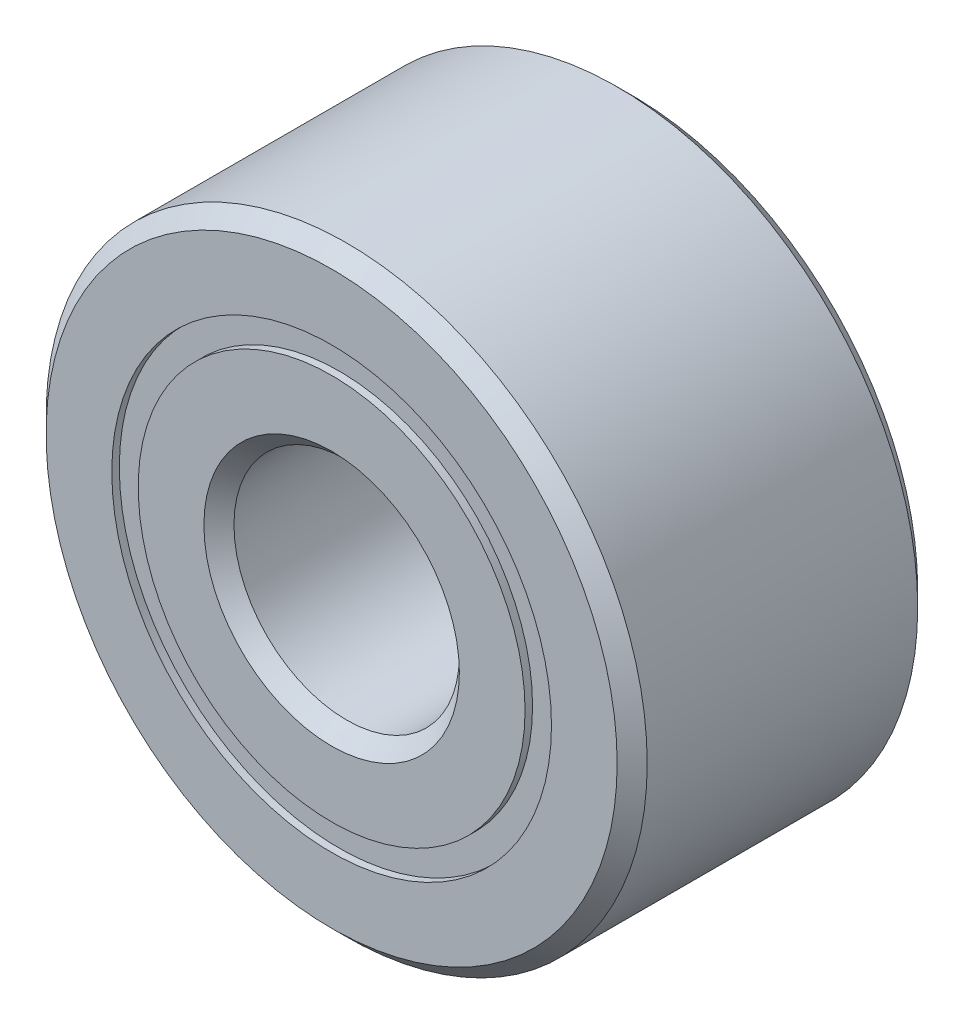
ISO-10303-21;
HEADER;
FILE_DESCRIPTION(('STEP AP214'),'2;1');
FILE_NAME('part.step','',(''),(''),'','','');
FILE_SCHEMA(('AUTOMOTIVE_DESIGN { 1 0 10303 214 1 1 1 1 }'));
ENDSEC;
DATA;
#1=APPLICATION_CONTEXT('core data for automotive mechanical design processes');
#2=APPLICATION_PROTOCOL_DEFINITION('international standard','automotive_design',2000,#1);
#3=PRODUCT_CONTEXT('',#1,'mechanical');
#4=PRODUCT('Part','Part','',(#3));
#5=PRODUCT_RELATED_PRODUCT_CATEGORY('part','',(#4));
#6=PRODUCT_DEFINITION_FORMATION('','',#4);
#7=PRODUCT_DEFINITION_CONTEXT('part definition',#1,'design');
#8=PRODUCT_DEFINITION('design','',#6,#7);
#9=PRODUCT_DEFINITION_SHAPE('','',#8);
#10=(LENGTH_UNIT() NAMED_UNIT(*) SI_UNIT(.MILLI.,.METRE.));
#11=(NAMED_UNIT(*) PLANE_ANGLE_UNIT() SI_UNIT($,.RADIAN.));
#12=(NAMED_UNIT(*) SI_UNIT($,.STERADIAN.) SOLID_ANGLE_UNIT());
#13=UNCERTAINTY_MEASURE_WITH_UNIT(LENGTH_MEASURE(1.E-05),#10,'distance_accuracy_value','');
#14=(GEOMETRIC_REPRESENTATION_CONTEXT(3) GLOBAL_UNCERTAINTY_ASSIGNED_CONTEXT((#13)) GLOBAL_UNIT_ASSIGNED_CONTEXT((#10,
#11,#12)) REPRESENTATION_CONTEXT('',''));
#15=CARTESIAN_POINT('',(0.,0.,0.));
#16=DIRECTION('',(0.,0.,1.));
#17=DIRECTION('',(1.,0.,0.));
#18=AXIS2_PLACEMENT_3D('',#15,#16,#17);
#19=CARTESIAN_POINT('',(0.,2.92582417582418,-1.9));
#20=DIRECTION('',(0.,0.,1.));
#21=DIRECTION('',(1.,0.,0.));
#22=AXIS2_PLACEMENT_3D('',#19,#20,#21);
#23=PLANE('',#22);
#24=CARTESIAN_POINT('',(0.,0.,-1.9));
#25=DIRECTION('',(0.,0.,1.));
#26=DIRECTION('',(1.,0.,0.));
#27=AXIS2_PLACEMENT_3D('',#24,#25,#26);
#28=CIRCLE('',#27,2.92582417582418);
#29=CARTESIAN_POINT('',(2.92582417582418,0.,-1.9));
#30=VERTEX_POINT('',#29);
#31=EDGE_CURVE('E57',#30,#30,#28,.T.);
#32=ORIENTED_EDGE('',*,*,#31,.F.);
#33=EDGE_LOOP('',(#32));
#34=FACE_BOUND('',#33,.T.);
#35=CARTESIAN_POINT('',(0.,0.,-1.9));
#36=DIRECTION('',(0.,0.,1.));
#37=DIRECTION('',(1.,0.,0.));
#38=AXIS2_PLACEMENT_3D('',#35,#36,#37);
#39=CIRCLE('',#38,2.57417582417583);
#40=CARTESIAN_POINT('',(2.57417582417583,0.,-1.9));
#41=VERTEX_POINT('',#40);
#42=EDGE_CURVE('E11',#41,#41,#39,.T.);
#43=ORIENTED_EDGE('',*,*,#42,.T.);
#44=EDGE_LOOP('',(#43));
#45=FACE_BOUND('',#44,.T.);
#46=ADVANCED_FACE('F43',(#34,#45),#23,.F.);
#47=CARTESIAN_POINT('',(0.,0.,2.));
#48=DIRECTION('',(0.,0.,1.));
#49=DIRECTION('',(1.,0.,0.));
#50=AXIS2_PLACEMENT_3D('',#47,#48,#49);
#51=CYLINDRICAL_SURFACE('',#50,2.57417582417583);
#52=ORIENTED_EDGE('',*,*,#42,.F.);
#53=EDGE_LOOP('',(#52));
#54=FACE_BOUND('',#53,.T.);
#55=CARTESIAN_POINT('',(0.,0.,-0.90611125012019));
#56=DIRECTION('',(0.,0.,1.));
#57=DIRECTION('',(1.,0.,0.));
#58=AXIS2_PLACEMENT_3D('',#55,#56,#57);
#59=CIRCLE('',#58,2.57417582417583);
#60=CARTESIAN_POINT('',(2.57417582417583,0.,-0.90611125012019));
#61=VERTEX_POINT('',#60);
#62=EDGE_CURVE('E49',#61,#61,#59,.T.);
#63=ORIENTED_EDGE('',*,*,#62,.T.);
#64=EDGE_LOOP('',(#63));
#65=FACE_BOUND('',#64,.T.);
#66=ADVANCED_FACE('F66',(#54,#65),#51,.F.);
#67=CARTESIAN_POINT('',(0.,2.92582417582418,-0.90611125012019));
#68=DIRECTION('',(0.,0.,-1.));
#69=DIRECTION('',(-1.,0.,0.));
#70=AXIS2_PLACEMENT_3D('',#67,#68,#69);
#71=PLANE('',#70);
#72=ORIENTED_EDGE('',*,*,#62,.F.);
#73=EDGE_LOOP('',(#72));
#74=FACE_BOUND('',#73,.T.);
#75=CARTESIAN_POINT('',(0.,0.,-0.90611125012019));
#76=DIRECTION('',(0.,0.,1.));
#77=DIRECTION('',(1.,0.,0.));
#78=AXIS2_PLACEMENT_3D('',#75,#76,#77);
#79=CIRCLE('',#78,2.92582417582418);
#80=CARTESIAN_POINT('',(2.92582417582418,0.,-0.90611125012019));
#81=VERTEX_POINT('',#80);
#82=EDGE_CURVE('E53',#81,#81,#79,.T.);
#83=ORIENTED_EDGE('',*,*,#82,.T.);
#84=EDGE_LOOP('',(#83));
#85=FACE_BOUND('',#84,.T.);
#86=ADVANCED_FACE('F70',(#74,#85),#71,.F.);
#87=CARTESIAN_POINT('',(0.,0.,2.));
#88=DIRECTION('',(0.,0.,1.));
#89=DIRECTION('',(1.,0.,0.));
#90=AXIS2_PLACEMENT_3D('',#87,#88,#89);
#91=CYLINDRICAL_SURFACE('',#90,2.92582417582418);
#92=ORIENTED_EDGE('',*,*,#82,.F.);
#93=EDGE_LOOP('',(#92));
#94=FACE_BOUND('',#93,.T.);
#95=ORIENTED_EDGE('',*,*,#31,.T.);
#96=EDGE_LOOP('',(#95));
#97=FACE_BOUND('',#96,.T.);
#98=ADVANCED_FACE('F63',(#94,#97),#91,.T.);
#99=CLOSED_SHELL('',(#46,#66,#86,#98));
#100=MANIFOLD_SOLID_BREP('B2',#99);
#101=CARTESIAN_POINT('',(0.,2.92582417582418,1.9));
#102=DIRECTION('',(0.,0.,-1.));
#103=DIRECTION('',(-1.,0.,0.));
#104=AXIS2_PLACEMENT_3D('',#101,#102,#103);
#105=PLANE('',#104);
#106=CARTESIAN_POINT('',(0.,0.,1.9));
#107=DIRECTION('',(0.,0.,1.));
#108=DIRECTION('',(1.,0.,0.));
#109=AXIS2_PLACEMENT_3D('',#106,#107,#108);
#110=CIRCLE('',#109,2.57417582417583);
#111=CARTESIAN_POINT('',(2.57417582417583,0.,1.9));
#112=VERTEX_POINT('',#111);
#113=EDGE_CURVE('E42',#112,#112,#110,.T.);
#114=ORIENTED_EDGE('',*,*,#113,.F.);
#115=EDGE_LOOP('',(#114));
#116=FACE_BOUND('',#115,.T.);
#117=CARTESIAN_POINT('',(0.,0.,1.9));
#118=DIRECTION('',(0.,0.,1.));
#119=DIRECTION('',(1.,0.,0.));
#120=AXIS2_PLACEMENT_3D('',#117,#118,#119);
#121=CIRCLE('',#120,2.92582417582418);
#122=CARTESIAN_POINT('',(2.92582417582418,0.,1.9));
#123=VERTEX_POINT('',#122);
#124=EDGE_CURVE('E124',#123,#123,#121,.T.);
#125=ORIENTED_EDGE('',*,*,#124,.T.);
#126=EDGE_LOOP('',(#125));
#127=FACE_BOUND('',#126,.T.);
#128=ADVANCED_FACE('F110',(#116,#127),#105,.F.);
#129=CARTESIAN_POINT('',(0.,0.,2.));
#130=DIRECTION('',(0.,0.,1.));
#131=DIRECTION('',(1.,0.,0.));
#132=AXIS2_PLACEMENT_3D('',#129,#130,#131);
#133=CYLINDRICAL_SURFACE('',#132,2.57417582417583);
#134=CARTESIAN_POINT('',(0.,0.,0.90611125012019));
#135=DIRECTION('',(0.,0.,1.));
#136=DIRECTION('',(1.,0.,0.));
#137=AXIS2_PLACEMENT_3D('',#134,#135,#136);
#138=CIRCLE('',#137,2.57417582417583);
#139=CARTESIAN_POINT('',(2.57417582417583,0.,0.90611125012019));
#140=VERTEX_POINT('',#139);
#141=EDGE_CURVE('E116',#140,#140,#138,.T.);
#142=ORIENTED_EDGE('',*,*,#141,.F.);
#143=EDGE_LOOP('',(#142));
#144=FACE_BOUND('',#143,.T.);
#145=ORIENTED_EDGE('',*,*,#113,.T.);
#146=EDGE_LOOP('',(#145));
#147=FACE_BOUND('',#146,.T.);
#148=ADVANCED_FACE('F139',(#144,#147),#133,.F.);
#149=CARTESIAN_POINT('',(0.,2.92582417582418,0.90611125012019));
#150=DIRECTION('',(0.,0.,1.));
#151=DIRECTION('',(1.,0.,0.));
#152=AXIS2_PLACEMENT_3D('',#149,#150,#151);
#153=PLANE('',#152);
#154=CARTESIAN_POINT('',(0.,0.,0.90611125012019));
#155=DIRECTION('',(0.,0.,1.));
#156=DIRECTION('',(1.,0.,0.));
#157=AXIS2_PLACEMENT_3D('',#154,#155,#156);
#158=CIRCLE('',#157,2.92582417582418);
#159=CARTESIAN_POINT('',(2.92582417582418,0.,0.90611125012019));
#160=VERTEX_POINT('',#159);
#161=EDGE_CURVE('E120',#160,#160,#158,.T.);
#162=ORIENTED_EDGE('',*,*,#161,.F.);
#163=EDGE_LOOP('',(#162));
#164=FACE_BOUND('',#163,.T.);
#165=ORIENTED_EDGE('',*,*,#141,.T.);
#166=EDGE_LOOP('',(#165));
#167=FACE_BOUND('',#166,.T.);
#168=ADVANCED_FACE('F134',(#164,#167),#153,.F.);
#169=CARTESIAN_POINT('',(0.,0.,2.));
#170=DIRECTION('',(0.,0.,1.));
#171=DIRECTION('',(1.,0.,0.));
#172=AXIS2_PLACEMENT_3D('',#169,#170,#171);
#173=CYLINDRICAL_SURFACE('',#172,2.92582417582418);
#174=ORIENTED_EDGE('',*,*,#124,.F.);
#175=EDGE_LOOP('',(#174));
#176=FACE_BOUND('',#175,.T.);
#177=ORIENTED_EDGE('',*,*,#161,.T.);
#178=EDGE_LOOP('',(#177));
#179=FACE_BOUND('',#178,.T.);
#180=ADVANCED_FACE('F131',(#176,#179),#173,.T.);
#181=CLOSED_SHELL('',(#128,#148,#168,#180));
#182=MANIFOLD_SOLID_BREP('B6',#181);
#183=CARTESIAN_POINT('',(-1.37499999999997,2.38156986040722,0.));
#184=DIRECTION('',(0.,0.,1.));
#185=DIRECTION('',(-0.499999999999989,0.866025403784445,0.));
#186=AXIS2_PLACEMENT_3D('',#183,#184,#185);
#187=SPHERICAL_SURFACE('',#186,0.90611125012019);
#188=CARTESIAN_POINT('',(-1.37499999999997,2.38156986040722,0.90611125012019));
#189=VERTEX_POINT('',#188);
#190=VERTEX_LOOP('',#189);
#191=FACE_BOUND('',#190,.T.);
#192=ADVANCED_FACE('F177',(#191),#187,.T.);
#193=CLOSED_SHELL('',(#192));
#194=MANIFOLD_SOLID_BREP('B37',#193);
#195=CARTESIAN_POINT('',(-2.38156986040719,1.37500000000003,0.));
#196=DIRECTION('',(0.,0.,1.));
#197=DIRECTION('',(-0.866025403784433,0.50000000000001,0.));
#198=AXIS2_PLACEMENT_3D('',#195,#196,#197);
#199=SPHERICAL_SURFACE('',#198,0.90611125012019);
#200=CARTESIAN_POINT('',(-2.38156986040719,1.37500000000003,0.90611125012019));
#201=VERTEX_POINT('',#200);
#202=VERTEX_LOOP('',#201);
#203=FACE_BOUND('',#202,.T.);
#204=ADVANCED_FACE('F197',(#203),#199,.T.);
#205=CLOSED_SHELL('',(#204));
#206=MANIFOLD_SOLID_BREP('B106',#205);
#207=CARTESIAN_POINT('',(-2.75,0.,0.));
#208=DIRECTION('',(0.,0.,1.));
#209=DIRECTION('',(-1.,0.,0.));
#210=AXIS2_PLACEMENT_3D('',#207,#208,#209);
#211=SPHERICAL_SURFACE('',#210,0.90611125012019);
#212=CARTESIAN_POINT('',(-2.75,0.,0.90611125012019));
#213=VERTEX_POINT('',#212);
#214=VERTEX_LOOP('',#213);
#215=FACE_BOUND('',#214,.T.);
#216=ADVANCED_FACE('F217',(#215),#211,.T.);
#217=CLOSED_SHELL('',(#216));
#218=MANIFOLD_SOLID_BREP('B173',#217);
#219=CARTESIAN_POINT('',(-2.38156986040722,-1.37499999999998,0.));
#220=DIRECTION('',(0.,0.,1.));
#221=DIRECTION('',(-0.866025403784443,-0.499999999999992,0.));
#222=AXIS2_PLACEMENT_3D('',#219,#220,#221);
#223=SPHERICAL_SURFACE('',#222,0.90611125012019);
#224=CARTESIAN_POINT('',(-2.38156986040722,-1.37499999999998,0.90611125012019));
#225=VERTEX_POINT('',#224);
#226=VERTEX_LOOP('',#225);
#227=FACE_BOUND('',#226,.T.);
#228=ADVANCED_FACE('F237',(#227),#223,.T.);
#229=CLOSED_SHELL('',(#228));
#230=MANIFOLD_SOLID_BREP('B193',#229);
#231=CARTESIAN_POINT('',(-1.37500000000002,-2.3815698604072,0.));
#232=DIRECTION('',(0.,0.,1.));
#233=DIRECTION('',(-0.500000000000007,-0.866025403784435,0.));
#234=AXIS2_PLACEMENT_3D('',#231,#232,#233);
#235=SPHERICAL_SURFACE('',#234,0.90611125012019);
#236=CARTESIAN_POINT('',(-1.37500000000002,-2.3815698604072,0.90611125012019));
#237=VERTEX_POINT('',#236);
#238=VERTEX_LOOP('',#237);
#239=FACE_BOUND('',#238,.T.);
#240=ADVANCED_FACE('F257',(#239),#235,.T.);
#241=CLOSED_SHELL('',(#240));
#242=MANIFOLD_SOLID_BREP('B213',#241);
#243=CARTESIAN_POINT('',(0.,-2.75,0.));
#244=DIRECTION('',(0.,0.,1.));
#245=DIRECTION('',(0.,-1.,0.));
#246=AXIS2_PLACEMENT_3D('',#243,#244,#245);
#247=SPHERICAL_SURFACE('',#246,0.90611125012019);
#248=CARTESIAN_POINT('',(0.,-2.75,0.90611125012019));
#249=VERTEX_POINT('',#248);
#250=VERTEX_LOOP('',#249);
#251=FACE_BOUND('',#250,.T.);
#252=ADVANCED_FACE('F277',(#251),#247,.T.);
#253=CLOSED_SHELL('',(#252));
#254=MANIFOLD_SOLID_BREP('B233',#253);
#255=CARTESIAN_POINT('',(1.37499999999999,-2.38156986040721,0.));
#256=DIRECTION('',(0.,0.,1.));
#257=DIRECTION('',(0.499999999999995,-0.866025403784442,0.));
#258=AXIS2_PLACEMENT_3D('',#255,#256,#257);
#259=SPHERICAL_SURFACE('',#258,0.90611125012019);
#260=CARTESIAN_POINT('',(1.37499999999999,-2.38156986040721,0.90611125012019));
#261=VERTEX_POINT('',#260);
#262=VERTEX_LOOP('',#261);
#263=FACE_BOUND('',#262,.T.);
#264=ADVANCED_FACE('F297',(#263),#259,.T.);
#265=CLOSED_SHELL('',(#264));
#266=MANIFOLD_SOLID_BREP('B253',#265);
#267=CARTESIAN_POINT('',(2.3815698604072,-1.37500000000001,0.));
#268=DIRECTION('',(0.,0.,1.));
#269=DIRECTION('',(0.866025403784436,-0.500000000000004,0.));
#270=AXIS2_PLACEMENT_3D('',#267,#268,#269);
#271=SPHERICAL_SURFACE('',#270,0.90611125012019);
#272=CARTESIAN_POINT('',(2.3815698604072,-1.37500000000001,0.90611125012019));
#273=VERTEX_POINT('',#272);
#274=VERTEX_LOOP('',#273);
#275=FACE_BOUND('',#274,.T.);
#276=ADVANCED_FACE('F317',(#275),#271,.T.);
#277=CLOSED_SHELL('',(#276));
#278=MANIFOLD_SOLID_BREP('B273',#277);
#279=CARTESIAN_POINT('',(2.75,0.,0.));
#280=DIRECTION('',(0.,0.,1.));
#281=DIRECTION('',(1.,0.,0.));
#282=AXIS2_PLACEMENT_3D('',#279,#280,#281);
#283=SPHERICAL_SURFACE('',#282,0.90611125012019);
#284=CARTESIAN_POINT('',(2.75,0.,0.90611125012019));
#285=VERTEX_POINT('',#284);
#286=VERTEX_LOOP('',#285);
#287=FACE_BOUND('',#286,.T.);
#288=ADVANCED_FACE('F337',(#287),#283,.T.);
#289=CLOSED_SHELL('',(#288));
#290=MANIFOLD_SOLID_BREP('B293',#289);
#291=CARTESIAN_POINT('',(2.38156986040721,1.37499999999999,0.));
#292=DIRECTION('',(0.,0.,1.));
#293=DIRECTION('',(0.86602540378444,0.499999999999998,0.));
#294=AXIS2_PLACEMENT_3D('',#291,#292,#293);
#295=SPHERICAL_SURFACE('',#294,0.90611125012019);
#296=CARTESIAN_POINT('',(2.38156986040721,1.37499999999999,0.90611125012019));
#297=VERTEX_POINT('',#296);
#298=VERTEX_LOOP('',#297);
#299=FACE_BOUND('',#298,.T.);
#300=ADVANCED_FACE('F357',(#299),#295,.T.);
#301=CLOSED_SHELL('',(#300));
#302=MANIFOLD_SOLID_BREP('B313',#301);
#303=CARTESIAN_POINT('',(1.375,2.3815698604072,0.));
#304=DIRECTION('',(0.,0.,1.));
#305=DIRECTION('',(0.500000000000001,0.866025403784438,0.));
#306=AXIS2_PLACEMENT_3D('',#303,#304,#305);
#307=SPHERICAL_SURFACE('',#306,0.90611125012019);
#308=CARTESIAN_POINT('',(1.375,2.3815698604072,0.90611125012019));
#309=VERTEX_POINT('',#308);
#310=VERTEX_LOOP('',#309);
#311=FACE_BOUND('',#310,.T.);
#312=ADVANCED_FACE('F377',(#311),#307,.T.);
#313=CLOSED_SHELL('',(#312));
#314=MANIFOLD_SOLID_BREP('B333',#313);
#315=CARTESIAN_POINT('',(0.,2.75,0.));
#316=DIRECTION('',(0.,0.,1.));
#317=DIRECTION('',(0.,1.,0.));
#318=AXIS2_PLACEMENT_3D('',#315,#316,#317);
#319=SPHERICAL_SURFACE('',#318,0.90611125012019);
#320=CARTESIAN_POINT('',(0.,2.75,0.90611125012019));
#321=VERTEX_POINT('',#320);
#322=VERTEX_LOOP('',#321);
#323=FACE_BOUND('',#322,.T.);
#324=ADVANCED_FACE('F399',(#323),#319,.T.);
#325=CLOSED_SHELL('',(#324));
#326=MANIFOLD_SOLID_BREP('B353',#325);
#327=CARTESIAN_POINT('',(0.,2.57417582417583,2.));
#328=DIRECTION('',(0.,0.,-1.));
#329=DIRECTION('',(-1.,0.,0.));
#330=AXIS2_PLACEMENT_3D('',#327,#328,#329);
#331=PLANE('',#330);
#332=CARTESIAN_POINT('',(0.,0.,2.));
#333=DIRECTION('',(0.,0.,1.));
#334=DIRECTION('',(1.,0.,0.));
#335=AXIS2_PLACEMENT_3D('',#332,#333,#334);
#336=CIRCLE('',#335,1.7);
#337=CARTESIAN_POINT('',(1.7,0.,2.));
#338=VERTEX_POINT('',#337);
#339=EDGE_CURVE('E446',#338,#338,#336,.T.);
#340=ORIENTED_EDGE('',*,*,#339,.F.);
#341=EDGE_LOOP('',(#340));
#342=FACE_BOUND('',#341,.T.);
#343=CARTESIAN_POINT('',(0.,0.,2.));
#344=DIRECTION('',(0.,0.,1.));
#345=DIRECTION('',(1.,0.,0.));
#346=AXIS2_PLACEMENT_3D('',#343,#344,#345);
#347=CIRCLE('',#346,2.57417582417583);
#348=CARTESIAN_POINT('',(2.57417582417583,0.,2.));
#349=VERTEX_POINT('',#348);
#350=EDGE_CURVE('E398',#349,#349,#347,.T.);
#351=ORIENTED_EDGE('',*,*,#350,.T.);
#352=EDGE_LOOP('',(#351));
#353=FACE_BOUND('',#352,.T.);
#354=ADVANCED_FACE('F418',(#342,#353),#331,.F.);
#355=CARTESIAN_POINT('',(0.,0.,2.));
#356=DIRECTION('',(0.,0.,1.));
#357=DIRECTION('',(1.,0.,0.));
#358=AXIS2_PLACEMENT_3D('',#355,#356,#357);
#359=CYLINDRICAL_SURFACE('',#358,2.57417582417583);
#360=ORIENTED_EDGE('',*,*,#350,.F.);
#361=EDGE_LOOP('',(#360));
#362=FACE_BOUND('',#361,.T.);
#363=CARTESIAN_POINT('',(0.,0.,0.888888888888889));
#364=DIRECTION('',(0.,0.,1.));
#365=DIRECTION('',(1.,0.,0.));
#366=AXIS2_PLACEMENT_3D('',#363,#364,#365);
#367=CIRCLE('',#366,2.57417582417583);
#368=CARTESIAN_POINT('',(2.57417582417583,0.,0.888888888888889));
#369=VERTEX_POINT('',#368);
#370=EDGE_CURVE('E424',#369,#369,#367,.T.);
#371=ORIENTED_EDGE('',*,*,#370,.T.);
#372=EDGE_LOOP('',(#371));
#373=FACE_BOUND('',#372,.T.);
#374=ADVANCED_FACE('F453',(#362,#373),#359,.T.);
#375=CARTESIAN_POINT('',(0.,0.,0.));
#376=DIRECTION('',(0.,0.,1.));
#377=DIRECTION('',(1.,0.,0.));
#378=AXIS2_PLACEMENT_3D('',#375,#376,#377);
#379=TOROIDAL_SURFACE('',#378,2.75,0.906111250120189);
#380=ORIENTED_EDGE('',*,*,#370,.F.);
#381=EDGE_LOOP('',(#380));
#382=FACE_BOUND('',#381,.T.);
#383=CARTESIAN_POINT('',(0.,0.,-0.88888888888889));
#384=DIRECTION('',(0.,0.,1.));
#385=DIRECTION('',(1.,0.,0.));
#386=AXIS2_PLACEMENT_3D('',#383,#384,#385);
#387=CIRCLE('',#386,2.57417582417583);
#388=CARTESIAN_POINT('',(2.57417582417583,0.,-0.88888888888889));
#389=VERTEX_POINT('',#388);
#390=EDGE_CURVE('E428',#389,#389,#387,.T.);
#391=ORIENTED_EDGE('',*,*,#390,.T.);
#392=EDGE_LOOP('',(#391));
#393=FACE_BOUND('',#392,.T.);
#394=ADVANCED_FACE('F457',(#382,#393),#379,.F.);
#395=CARTESIAN_POINT('',(0.,0.,2.));
#396=DIRECTION('',(0.,0.,1.));
#397=DIRECTION('',(1.,0.,0.));
#398=AXIS2_PLACEMENT_3D('',#395,#396,#397);
#399=CYLINDRICAL_SURFACE('',#398,2.57417582417583);
#400=ORIENTED_EDGE('',*,*,#390,.F.);
#401=EDGE_LOOP('',(#400));
#402=FACE_BOUND('',#401,.T.);
#403=CARTESIAN_POINT('',(0.,0.,-2.));
#404=DIRECTION('',(0.,0.,1.));
#405=DIRECTION('',(1.,0.,0.));
#406=AXIS2_PLACEMENT_3D('',#403,#404,#405);
#407=CIRCLE('',#406,2.57417582417583);
#408=CARTESIAN_POINT('',(2.57417582417583,0.,-2.));
#409=VERTEX_POINT('',#408);
#410=EDGE_CURVE('E432',#409,#409,#407,.T.);
#411=ORIENTED_EDGE('',*,*,#410,.T.);
#412=EDGE_LOOP('',(#411));
#413=FACE_BOUND('',#412,.T.);
#414=ADVANCED_FACE('F462',(#402,#413),#399,.T.);
#415=CARTESIAN_POINT('',(0.,1.7,-2.));
#416=DIRECTION('',(0.,0.,1.));
#417=DIRECTION('',(1.,0.,0.));
#418=AXIS2_PLACEMENT_3D('',#415,#416,#417);
#419=PLANE('',#418);
#420=ORIENTED_EDGE('',*,*,#410,.F.);
#421=EDGE_LOOP('',(#420));
#422=FACE_BOUND('',#421,.T.);
#423=CARTESIAN_POINT('',(0.,0.,-2.));
#424=DIRECTION('',(0.,0.,1.));
#425=DIRECTION('',(1.,0.,0.));
#426=AXIS2_PLACEMENT_3D('',#423,#424,#425);
#427=CIRCLE('',#426,1.7);
#428=CARTESIAN_POINT('',(1.7,0.,-2.));
#429=VERTEX_POINT('',#428);
#430=EDGE_CURVE('E437',#429,#429,#427,.T.);
#431=ORIENTED_EDGE('',*,*,#430,.T.);
#432=EDGE_LOOP('',(#431));
#433=FACE_BOUND('',#432,.T.);
#434=ADVANCED_FACE('F468',(#422,#433),#419,.F.);
#435=CARTESIAN_POINT('',(0.,0.,-1.8));
#436=DIRECTION('',(0.,0.,-1.));
#437=DIRECTION('',(-1.,0.,0.));
#438=AXIS2_PLACEMENT_3D('',#435,#436,#437);
#439=CONICAL_SURFACE('',#438,1.5,0.785398163397443);
#440=ORIENTED_EDGE('',*,*,#430,.F.);
#441=EDGE_LOOP('',(#440));
#442=FACE_BOUND('',#441,.T.);
#443=CARTESIAN_POINT('',(0.,0.,-1.8));
#444=DIRECTION('',(0.,0.,1.));
#445=DIRECTION('',(1.,0.,0.));
#446=AXIS2_PLACEMENT_3D('',#443,#444,#445);
#447=CIRCLE('',#446,1.5);
#448=CARTESIAN_POINT('',(1.5,0.,-1.8));
#449=VERTEX_POINT('',#448);
#450=EDGE_CURVE('E440',#449,#449,#447,.T.);
#451=ORIENTED_EDGE('',*,*,#450,.T.);
#452=EDGE_LOOP('',(#451));
#453=FACE_BOUND('',#452,.T.);
#454=ADVANCED_FACE('F472',(#442,#453),#439,.F.);
#455=CARTESIAN_POINT('',(0.,0.,2.));
#456=DIRECTION('',(0.,0.,1.));
#457=DIRECTION('',(1.,0.,0.));
#458=AXIS2_PLACEMENT_3D('',#455,#456,#457);
#459=CYLINDRICAL_SURFACE('',#458,1.5);
#460=ORIENTED_EDGE('',*,*,#450,.F.);
#461=EDGE_LOOP('',(#460));
#462=FACE_BOUND('',#461,.T.);
#463=CARTESIAN_POINT('',(0.,0.,1.8));
#464=DIRECTION('',(0.,0.,1.));
#465=DIRECTION('',(1.,0.,0.));
#466=AXIS2_PLACEMENT_3D('',#463,#464,#465);
#467=CIRCLE('',#466,1.5);
#468=CARTESIAN_POINT('',(1.5,0.,1.8));
#469=VERTEX_POINT('',#468);
#470=EDGE_CURVE('E443',#469,#469,#467,.T.);
#471=ORIENTED_EDGE('',*,*,#470,.T.);
#472=EDGE_LOOP('',(#471));
#473=FACE_BOUND('',#472,.T.);
#474=ADVANCED_FACE('F476',(#462,#473),#459,.F.);
#475=CARTESIAN_POINT('',(0.,0.,2.));
#476=DIRECTION('',(0.,0.,1.));
#477=DIRECTION('',(1.,0.,0.));
#478=AXIS2_PLACEMENT_3D('',#475,#476,#477);
#479=CONICAL_SURFACE('',#478,1.7,0.785398163397454);
#480=ORIENTED_EDGE('',*,*,#470,.F.);
#481=EDGE_LOOP('',(#480));
#482=FACE_BOUND('',#481,.T.);
#483=ORIENTED_EDGE('',*,*,#339,.T.);
#484=EDGE_LOOP('',(#483));
#485=FACE_BOUND('',#484,.T.);
#486=ADVANCED_FACE('F450',(#482,#485),#479,.F.);
#487=CLOSED_SHELL('',(#354,#374,#394,#414,#434,#454,#474,#486));
#488=MANIFOLD_SOLID_BREP('B373',#487);
#489=CARTESIAN_POINT('',(0.,0.,1.8));
#490=DIRECTION('',(0.,0.,-1.));
#491=DIRECTION('',(-1.,0.,0.));
#492=AXIS2_PLACEMENT_3D('',#489,#490,#491);
#493=CONICAL_SURFACE('',#492,4.,0.785398163397449);
#494=CARTESIAN_POINT('',(0.,0.,2.));
#495=DIRECTION('',(0.,0.,1.));
#496=DIRECTION('',(1.,0.,0.));
#497=AXIS2_PLACEMENT_3D('',#494,#495,#496);
#498=CIRCLE('',#497,3.8);
#499=CARTESIAN_POINT('',(3.8,0.,2.));
#500=VERTEX_POINT('',#499);
#501=EDGE_CURVE('E567',#500,#500,#498,.T.);
#502=ORIENTED_EDGE('',*,*,#501,.F.);
#503=EDGE_LOOP('',(#502));
#504=FACE_BOUND('',#503,.T.);
#505=CARTESIAN_POINT('',(0.,0.,1.8));
#506=DIRECTION('',(0.,0.,1.));
#507=DIRECTION('',(1.,0.,0.));
#508=AXIS2_PLACEMENT_3D('',#505,#506,#507);
#509=CIRCLE('',#508,4.);
#510=CARTESIAN_POINT('',(4.,0.,1.8));
#511=VERTEX_POINT('',#510);
#512=EDGE_CURVE('E417',#511,#511,#509,.T.);
#513=ORIENTED_EDGE('',*,*,#512,.T.);
#514=EDGE_LOOP('',(#513));
#515=FACE_BOUND('',#514,.T.);
#516=ADVANCED_FACE('F539',(#504,#515),#493,.T.);
#517=CARTESIAN_POINT('',(0.,0.,2.));
#518=DIRECTION('',(0.,0.,1.));
#519=DIRECTION('',(1.,0.,0.));
#520=AXIS2_PLACEMENT_3D('',#517,#518,#519);
#521=CYLINDRICAL_SURFACE('',#520,4.);
#522=ORIENTED_EDGE('',*,*,#512,.F.);
#523=EDGE_LOOP('',(#522));
#524=FACE_BOUND('',#523,.T.);
#525=CARTESIAN_POINT('',(0.,0.,-1.8));
#526=DIRECTION('',(0.,0.,1.));
#527=DIRECTION('',(1.,0.,0.));
#528=AXIS2_PLACEMENT_3D('',#525,#526,#527);
#529=CIRCLE('',#528,4.);
#530=CARTESIAN_POINT('',(4.,0.,-1.8));
#531=VERTEX_POINT('',#530);
#532=EDGE_CURVE('E545',#531,#531,#529,.T.);
#533=ORIENTED_EDGE('',*,*,#532,.T.);
#534=EDGE_LOOP('',(#533));
#535=FACE_BOUND('',#534,.T.);
#536=ADVANCED_FACE('F574',(#524,#535),#521,.T.);
#537=CARTESIAN_POINT('',(0.,0.,-2.));
#538=DIRECTION('',(0.,0.,1.));
#539=DIRECTION('',(1.,0.,0.));
#540=AXIS2_PLACEMENT_3D('',#537,#538,#539);
#541=CONICAL_SURFACE('',#540,3.8,0.785398163397452);
#542=ORIENTED_EDGE('',*,*,#532,.F.);
#543=EDGE_LOOP('',(#542));
#544=FACE_BOUND('',#543,.T.);
#545=CARTESIAN_POINT('',(0.,0.,-2.));
#546=DIRECTION('',(0.,0.,1.));
#547=DIRECTION('',(1.,0.,0.));
#548=AXIS2_PLACEMENT_3D('',#545,#546,#547);
#549=CIRCLE('',#548,3.8);
#550=CARTESIAN_POINT('',(3.8,0.,-2.));
#551=VERTEX_POINT('',#550);
#552=EDGE_CURVE('E549',#551,#551,#549,.T.);
#553=ORIENTED_EDGE('',*,*,#552,.T.);
#554=EDGE_LOOP('',(#553));
#555=FACE_BOUND('',#554,.T.);
#556=ADVANCED_FACE('F578',(#544,#555),#541,.T.);
#557=CARTESIAN_POINT('',(0.,3.8,-2.));
#558=DIRECTION('',(0.,0.,1.));
#559=DIRECTION('',(1.,0.,0.));
#560=AXIS2_PLACEMENT_3D('',#557,#558,#559);
#561=PLANE('',#560);
#562=ORIENTED_EDGE('',*,*,#552,.F.);
#563=EDGE_LOOP('',(#562));
#564=FACE_BOUND('',#563,.T.);
#565=CARTESIAN_POINT('',(0.,0.,-2.));
#566=DIRECTION('',(0.,0.,1.));
#567=DIRECTION('',(1.,0.,0.));
#568=AXIS2_PLACEMENT_3D('',#565,#566,#567);
#569=CIRCLE('',#568,2.92582417582418);
#570=CARTESIAN_POINT('',(2.92582417582418,0.,-2.));
#571=VERTEX_POINT('',#570);
#572=EDGE_CURVE('E553',#571,#571,#569,.T.);
#573=ORIENTED_EDGE('',*,*,#572,.T.);
#574=EDGE_LOOP('',(#573));
#575=FACE_BOUND('',#574,.T.);
#576=ADVANCED_FACE('F583',(#564,#575),#561,.F.);
#577=CARTESIAN_POINT('',(0.,0.,2.));
#578=DIRECTION('',(0.,0.,1.));
#579=DIRECTION('',(1.,0.,0.));
#580=AXIS2_PLACEMENT_3D('',#577,#578,#579);
#581=CYLINDRICAL_SURFACE('',#580,2.92582417582418);
#582=ORIENTED_EDGE('',*,*,#572,.F.);
#583=EDGE_LOOP('',(#582));
#584=FACE_BOUND('',#583,.T.);
#585=CARTESIAN_POINT('',(0.,0.,-0.888888888888889));
#586=DIRECTION('',(0.,0.,1.));
#587=DIRECTION('',(1.,0.,0.));
#588=AXIS2_PLACEMENT_3D('',#585,#586,#587);
#589=CIRCLE('',#588,2.92582417582418);
#590=CARTESIAN_POINT('',(2.92582417582418,0.,-0.888888888888889));
#591=VERTEX_POINT('',#590);
#592=EDGE_CURVE('E558',#591,#591,#589,.T.);
#593=ORIENTED_EDGE('',*,*,#592,.T.);
#594=EDGE_LOOP('',(#593));
#595=FACE_BOUND('',#594,.T.);
#596=ADVANCED_FACE('F589',(#584,#595),#581,.F.);
#597=CARTESIAN_POINT('',(0.,0.,0.));
#598=DIRECTION('',(0.,0.,1.));
#599=DIRECTION('',(1.,0.,0.));
#600=AXIS2_PLACEMENT_3D('',#597,#598,#599);
#601=TOROIDAL_SURFACE('',#600,2.75,0.90611125012019);
#602=ORIENTED_EDGE('',*,*,#592,.F.);
#603=EDGE_LOOP('',(#602));
#604=FACE_BOUND('',#603,.T.);
#605=CARTESIAN_POINT('',(0.,0.,0.888888888888889));
#606=DIRECTION('',(0.,0.,1.));
#607=DIRECTION('',(1.,0.,0.));
#608=AXIS2_PLACEMENT_3D('',#605,#606,#607);
#609=CIRCLE('',#608,2.92582417582418);
#610=CARTESIAN_POINT('',(2.92582417582418,0.,0.888888888888889));
#611=VERTEX_POINT('',#610);
#612=EDGE_CURVE('E561',#611,#611,#609,.T.);
#613=ORIENTED_EDGE('',*,*,#612,.T.);
#614=EDGE_LOOP('',(#613));
#615=FACE_BOUND('',#614,.T.);
#616=ADVANCED_FACE('F593',(#604,#615),#601,.F.);
#617=CARTESIAN_POINT('',(0.,0.,2.));
#618=DIRECTION('',(0.,0.,1.));
#619=DIRECTION('',(1.,0.,0.));
#620=AXIS2_PLACEMENT_3D('',#617,#618,#619);
#621=CYLINDRICAL_SURFACE('',#620,2.92582417582418);
#622=ORIENTED_EDGE('',*,*,#612,.F.);
#623=EDGE_LOOP('',(#622));
#624=FACE_BOUND('',#623,.T.);
#625=CARTESIAN_POINT('',(0.,0.,2.));
#626=DIRECTION('',(0.,0.,1.));
#627=DIRECTION('',(1.,0.,0.));
#628=AXIS2_PLACEMENT_3D('',#625,#626,#627);
#629=CIRCLE('',#628,2.92582417582418);
#630=CARTESIAN_POINT('',(2.92582417582418,0.,2.));
#631=VERTEX_POINT('',#630);
#632=EDGE_CURVE('E564',#631,#631,#629,.T.);
#633=ORIENTED_EDGE('',*,*,#632,.T.);
#634=EDGE_LOOP('',(#633));
#635=FACE_BOUND('',#634,.T.);
#636=ADVANCED_FACE('F597',(#624,#635),#621,.F.);
#637=CARTESIAN_POINT('',(0.,3.8,2.));
#638=DIRECTION('',(0.,0.,-1.));
#639=DIRECTION('',(-1.,0.,0.));
#640=AXIS2_PLACEMENT_3D('',#637,#638,#639);
#641=PLANE('',#640);
#642=ORIENTED_EDGE('',*,*,#632,.F.);
#643=EDGE_LOOP('',(#642));
#644=FACE_BOUND('',#643,.T.);
#645=ORIENTED_EDGE('',*,*,#501,.T.);
#646=EDGE_LOOP('',(#645));
#647=FACE_BOUND('',#646,.T.);
#648=ADVANCED_FACE('F571',(#644,#647),#641,.F.);
#649=CLOSED_SHELL('',(#516,#536,#556,#576,#596,#616,#636,#648));
#650=MANIFOLD_SOLID_BREP('B393',#649);
#651=ADVANCED_BREP_SHAPE_REPRESENTATION('',(#18,#100,#182,#194,#206,#218,#230,#242,#254,#266,
#278,#290,#302,#314,#326,#488,#650),#14);
#652=SHAPE_DEFINITION_REPRESENTATION(#9,#651);
ENDSEC;
END-ISO-10303-21;
